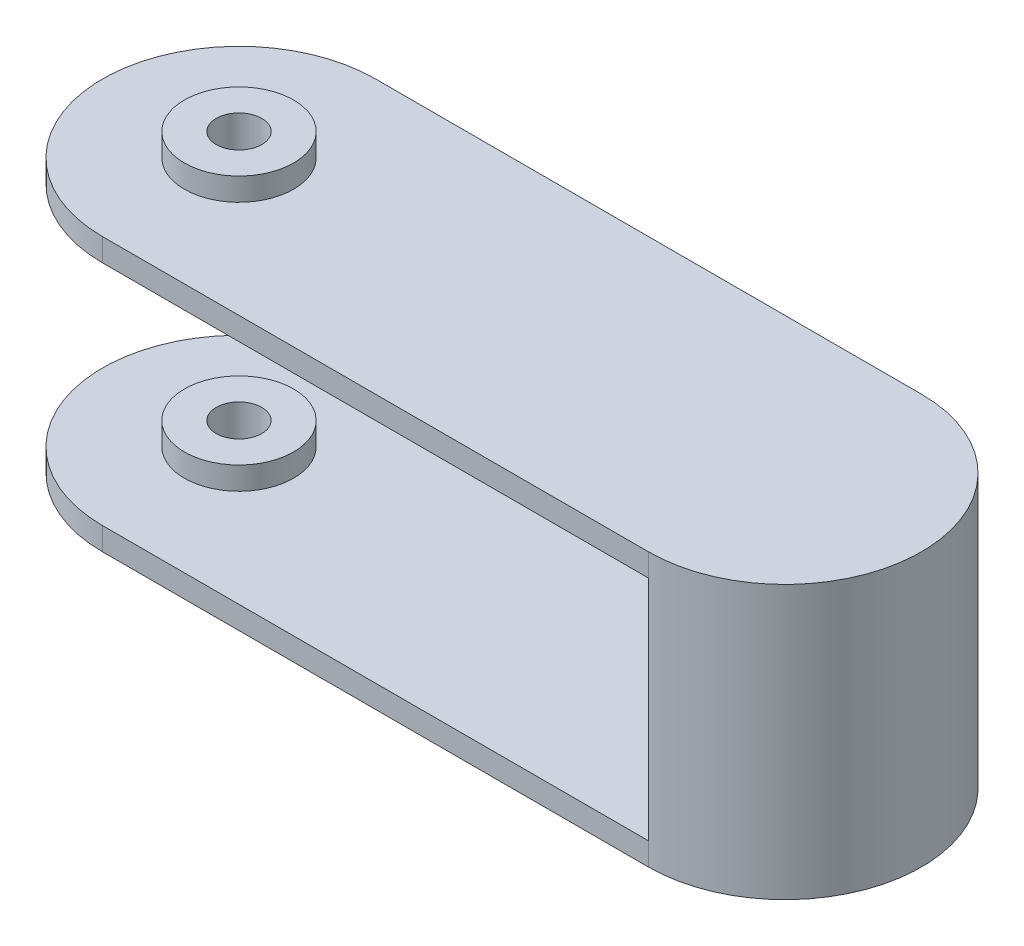
ISO-10303-21;
HEADER;
FILE_DESCRIPTION(('STEP AP214'),'2;1');
FILE_NAME('part.step','',(''),(''),'','','');
FILE_SCHEMA(('AUTOMOTIVE_DESIGN { 1 0 10303 214 1 1 1 1 }'));
ENDSEC;
DATA;
#1=APPLICATION_CONTEXT('core data for automotive mechanical design processes');
#2=APPLICATION_PROTOCOL_DEFINITION('international standard','automotive_design',2000,#1);
#3=PRODUCT_CONTEXT('',#1,'mechanical');
#4=PRODUCT('Part','Part','',(#3));
#5=PRODUCT_RELATED_PRODUCT_CATEGORY('part','',(#4));
#6=PRODUCT_DEFINITION_FORMATION('','',#4);
#7=PRODUCT_DEFINITION_CONTEXT('part definition',#1,'design');
#8=PRODUCT_DEFINITION('design','',#6,#7);
#9=PRODUCT_DEFINITION_SHAPE('','',#8);
#10=(LENGTH_UNIT() NAMED_UNIT(*) SI_UNIT(.MILLI.,.METRE.));
#11=(NAMED_UNIT(*) PLANE_ANGLE_UNIT() SI_UNIT($,.RADIAN.));
#12=(NAMED_UNIT(*) SI_UNIT($,.STERADIAN.) SOLID_ANGLE_UNIT());
#13=UNCERTAINTY_MEASURE_WITH_UNIT(LENGTH_MEASURE(1.E-05),#10,'distance_accuracy_value','');
#14=(GEOMETRIC_REPRESENTATION_CONTEXT(3) GLOBAL_UNCERTAINTY_ASSIGNED_CONTEXT((#13)) GLOBAL_UNIT_ASSIGNED_CONTEXT((#10,
#11,#12)) REPRESENTATION_CONTEXT('',''));
#15=CARTESIAN_POINT('',(0.,0.,0.));
#16=DIRECTION('',(0.,0.,1.));
#17=DIRECTION('',(1.,0.,0.));
#18=AXIS2_PLACEMENT_3D('',#15,#16,#17);
#19=CARTESIAN_POINT('',(-30.,30.,0.));
#20=DIRECTION('',(0.,1.,0.));
#21=DIRECTION('',(0.,0.,1.));
#22=AXIS2_PLACEMENT_3D('',#19,#20,#21);
#23=PLANE('',#22);
#24=CARTESIAN_POINT('',(-30.,30.,0.));
#25=DIRECTION('',(0.,1.,0.));
#26=DIRECTION('',(0.,0.,1.));
#27=AXIS2_PLACEMENT_3D('',#24,#25,#26);
#28=CIRCLE('',#27,15.);
#29=CARTESIAN_POINT('',(-30.,30.,-15.));
#30=VERTEX_POINT('',#29);
#31=CARTESIAN_POINT('',(-30.,30.,15.));
#32=VERTEX_POINT('',#31);
#33=EDGE_CURVE('E184',#30,#32,#28,.T.);
#34=ORIENTED_EDGE('',*,*,#33,.T.);
#35=DIRECTION('',(1.,0.,0.));
#36=VECTOR('',#35,1.);
#37=CARTESIAN_POINT('',(-30.,30.,15.));
#38=LINE('',#37,#36);
#39=CARTESIAN_POINT('',(30.,30.,15.));
#40=VERTEX_POINT('',#39);
#41=EDGE_CURVE('E102',#32,#40,#38,.T.);
#42=ORIENTED_EDGE('',*,*,#41,.T.);
#43=CARTESIAN_POINT('',(30.,30.,0.));
#44=DIRECTION('',(0.,1.,0.));
#45=DIRECTION('',(0.,0.,1.));
#46=AXIS2_PLACEMENT_3D('',#43,#44,#45);
#47=CIRCLE('',#46,15.);
#48=CARTESIAN_POINT('',(30.,30.,-15.));
#49=VERTEX_POINT('',#48);
#50=EDGE_CURVE('E190',#40,#49,#47,.T.);
#51=ORIENTED_EDGE('',*,*,#50,.T.);
#52=DIRECTION('',(1.,0.,0.));
#53=VECTOR('',#52,1.);
#54=CARTESIAN_POINT('',(-30.,30.,-15.));
#55=LINE('',#54,#53);
#56=EDGE_CURVE('E154',#30,#49,#55,.T.);
#57=ORIENTED_EDGE('',*,*,#56,.F.);
#58=EDGE_LOOP('',(#34,#42,#51,#57));
#59=FACE_BOUND('',#58,.T.);
#60=CARTESIAN_POINT('',(-30.,30.,0.));
#61=DIRECTION('',(0.,1.,0.));
#62=DIRECTION('',(0.,0.,1.));
#63=AXIS2_PLACEMENT_3D('',#60,#61,#62);
#64=CIRCLE('',#63,6.);
#65=CARTESIAN_POINT('',(-30.,30.,6.));
#66=VERTEX_POINT('',#65);
#67=EDGE_CURVE('E421',#66,#66,#64,.T.);
#68=ORIENTED_EDGE('',*,*,#67,.F.);
#69=EDGE_LOOP('',(#68));
#70=FACE_BOUND('',#69,.T.);
#71=ADVANCED_FACE('F45',(#59,#70),#23,.T.);
#72=CARTESIAN_POINT('',(-30.,30.,0.));
#73=DIRECTION('',(0.,-1.,0.));
#74=DIRECTION('',(0.,0.,-1.));
#75=AXIS2_PLACEMENT_3D('',#72,#73,#74);
#76=CYLINDRICAL_SURFACE('',#75,15.);
#77=DIRECTION('',(0.,-1.,0.));
#78=VECTOR('',#77,1.);
#79=CARTESIAN_POINT('',(-30.,30.,-15.));
#80=LINE('',#79,#78);
#81=CARTESIAN_POINT('',(-30.,27.5,-15.));
#82=VERTEX_POINT('',#81);
#83=EDGE_CURVE('E72',#30,#82,#80,.T.);
#84=ORIENTED_EDGE('',*,*,#83,.T.);
#85=CARTESIAN_POINT('',(-30.,27.5,0.));
#86=DIRECTION('',(0.,1.,0.));
#87=DIRECTION('',(0.,0.,1.));
#88=AXIS2_PLACEMENT_3D('',#85,#86,#87);
#89=CIRCLE('',#88,15.);
#90=CARTESIAN_POINT('',(-30.,27.5,15.));
#91=VERTEX_POINT('',#90);
#92=EDGE_CURVE('E137',#82,#91,#89,.T.);
#93=ORIENTED_EDGE('',*,*,#92,.T.);
#94=DIRECTION('',(0.,-1.,0.));
#95=VECTOR('',#94,1.);
#96=CARTESIAN_POINT('',(-30.,30.,15.));
#97=LINE('',#96,#95);
#98=EDGE_CURVE('E11',#32,#91,#97,.T.);
#99=ORIENTED_EDGE('',*,*,#98,.F.);
#100=ORIENTED_EDGE('',*,*,#33,.F.);
#101=EDGE_LOOP('',(#84,#93,#99,#100));
#102=FACE_BOUND('',#101,.T.);
#103=ADVANCED_FACE('F221',(#102),#76,.T.);
#104=CARTESIAN_POINT('',(-30.,30.,15.));
#105=DIRECTION('',(0.,0.,-1.));
#106=DIRECTION('',(-1.,0.,0.));
#107=AXIS2_PLACEMENT_3D('',#104,#105,#106);
#108=PLANE('',#107);
#109=ORIENTED_EDGE('',*,*,#98,.T.);
#110=DIRECTION('',(-1.,0.,0.));
#111=VECTOR('',#110,1.);
#112=CARTESIAN_POINT('',(-45.,27.5,15.));
#113=LINE('',#112,#111);
#114=CARTESIAN_POINT('',(30.,27.5,15.));
#115=VERTEX_POINT('',#114);
#116=EDGE_CURVE('E409',#115,#91,#113,.T.);
#117=ORIENTED_EDGE('',*,*,#116,.F.);
#118=DIRECTION('',(0.,-1.,0.));
#119=VECTOR('',#118,1.);
#120=CARTESIAN_POINT('',(30.,30.,15.));
#121=LINE('',#120,#119);
#122=EDGE_CURVE('E160',#40,#115,#121,.T.);
#123=ORIENTED_EDGE('',*,*,#122,.F.);
#124=ORIENTED_EDGE('',*,*,#41,.F.);
#125=EDGE_LOOP('',(#109,#117,#123,#124));
#126=FACE_BOUND('',#125,.T.);
#127=ADVANCED_FACE('F226',(#126),#108,.F.);
#128=CARTESIAN_POINT('',(-30.,30.,-15.));
#129=DIRECTION('',(0.,0.,-1.));
#130=DIRECTION('',(-1.,0.,0.));
#131=AXIS2_PLACEMENT_3D('',#128,#129,#130);
#132=PLANE('',#131);
#133=DIRECTION('',(-1.,0.,0.));
#134=VECTOR('',#133,1.);
#135=CARTESIAN_POINT('',(-45.,27.5,-15.));
#136=LINE('',#135,#134);
#137=CARTESIAN_POINT('',(30.,27.5,-15.));
#138=VERTEX_POINT('',#137);
#139=EDGE_CURVE('E135',#138,#82,#136,.T.);
#140=ORIENTED_EDGE('',*,*,#139,.T.);
#141=ORIENTED_EDGE('',*,*,#83,.F.);
#142=ORIENTED_EDGE('',*,*,#56,.T.);
#143=DIRECTION('',(0.,-1.,0.));
#144=VECTOR('',#143,1.);
#145=CARTESIAN_POINT('',(30.,30.,-15.));
#146=LINE('',#145,#144);
#147=EDGE_CURVE('E147',#49,#138,#146,.T.);
#148=ORIENTED_EDGE('',*,*,#147,.T.);
#149=EDGE_LOOP('',(#140,#141,#142,#148));
#150=FACE_BOUND('',#149,.T.);
#151=ADVANCED_FACE('F152',(#150),#132,.T.);
#152=CARTESIAN_POINT('',(-30.,30.000012,0.));
#153=DIRECTION('',(0.,-1.,0.));
#154=DIRECTION('',(0.,0.,-1.));
#155=AXIS2_PLACEMENT_3D('',#152,#153,#154);
#156=CYLINDRICAL_SURFACE('',#155,2.5);
#157=CARTESIAN_POINT('',(-30.,27.5,0.));
#158=DIRECTION('',(0.,1.,0.));
#159=DIRECTION('',(0.,0.,1.));
#160=AXIS2_PLACEMENT_3D('',#157,#158,#159);
#161=CIRCLE('',#160,2.5);
#162=CARTESIAN_POINT('',(-30.,27.5,2.5));
#163=VERTEX_POINT('',#162);
#164=EDGE_CURVE('E171',#163,#163,#161,.T.);
#165=ORIENTED_EDGE('',*,*,#164,.F.);
#166=EDGE_LOOP('',(#165));
#167=FACE_BOUND('',#166,.T.);
#168=CARTESIAN_POINT('',(-30.,32.5,0.));
#169=DIRECTION('',(0.,1.,0.));
#170=DIRECTION('',(0.,0.,1.));
#171=AXIS2_PLACEMENT_3D('',#168,#169,#170);
#172=CIRCLE('',#171,2.5);
#173=CARTESIAN_POINT('',(-30.,32.5,2.5));
#174=VERTEX_POINT('',#173);
#175=EDGE_CURVE('E425',#174,#174,#172,.T.);
#176=ORIENTED_EDGE('',*,*,#175,.T.);
#177=EDGE_LOOP('',(#176));
#178=FACE_BOUND('',#177,.T.);
#179=ADVANCED_FACE('F220',(#167,#178),#156,.F.);
#180=CARTESIAN_POINT('',(-30.,2.5,15.));
#181=VERTEX_POINT('',#180);
#182=CARTESIAN_POINT('',(-30.,0.,15.));
#183=VERTEX_POINT('',#182);
#184=EDGE_CURVE('E55',#181,#183,#97,.T.);
#185=ORIENTED_EDGE('',*,*,#184,.F.);
#186=CARTESIAN_POINT('',(-30.,2.5,0.));
#187=DIRECTION('',(0.,-1.,0.));
#188=DIRECTION('',(0.,0.,-1.));
#189=AXIS2_PLACEMENT_3D('',#186,#187,#188);
#190=CIRCLE('',#189,15.);
#191=CARTESIAN_POINT('',(-30.,2.5,-15.));
#192=VERTEX_POINT('',#191);
#193=EDGE_CURVE('E132',#181,#192,#190,.T.);
#194=ORIENTED_EDGE('',*,*,#193,.T.);
#195=CARTESIAN_POINT('',(-30.,0.,-15.));
#196=VERTEX_POINT('',#195);
#197=EDGE_CURVE('E95',#192,#196,#80,.T.);
#198=ORIENTED_EDGE('',*,*,#197,.T.);
#199=CARTESIAN_POINT('',(-30.,0.,0.));
#200=DIRECTION('',(0.,1.,0.));
#201=DIRECTION('',(0.,0.,1.));
#202=AXIS2_PLACEMENT_3D('',#199,#200,#201);
#203=CIRCLE('',#202,15.);
#204=EDGE_CURVE('E170',#196,#183,#203,.T.);
#205=ORIENTED_EDGE('',*,*,#204,.T.);
#206=EDGE_LOOP('',(#185,#194,#198,#205));
#207=FACE_BOUND('',#206,.T.);
#208=ADVANCED_FACE('F47',(#207),#76,.T.);
#209=CARTESIAN_POINT('',(30.,2.5,15.));
#210=VERTEX_POINT('',#209);
#211=CARTESIAN_POINT('',(30.,0.,15.));
#212=VERTEX_POINT('',#211);
#213=EDGE_CURVE('E156',#210,#212,#121,.T.);
#214=ORIENTED_EDGE('',*,*,#213,.F.);
#215=DIRECTION('',(1.,0.,0.));
#216=VECTOR('',#215,1.);
#217=CARTESIAN_POINT('',(-45.,2.5,15.));
#218=LINE('',#217,#216);
#219=EDGE_CURVE('E415',#181,#210,#218,.T.);
#220=ORIENTED_EDGE('',*,*,#219,.F.);
#221=ORIENTED_EDGE('',*,*,#184,.T.);
#222=DIRECTION('',(1.,0.,0.));
#223=VECTOR('',#222,1.);
#224=CARTESIAN_POINT('',(-30.,0.,15.));
#225=LINE('',#224,#223);
#226=EDGE_CURVE('E197',#183,#212,#225,.T.);
#227=ORIENTED_EDGE('',*,*,#226,.T.);
#228=EDGE_LOOP('',(#214,#220,#221,#227));
#229=FACE_BOUND('',#228,.T.);
#230=ADVANCED_FACE('F217',(#229),#108,.F.);
#231=CARTESIAN_POINT('',(30.,30.,0.));
#232=DIRECTION('',(0.,-1.,0.));
#233=DIRECTION('',(0.,0.,-1.));
#234=AXIS2_PLACEMENT_3D('',#231,#232,#233);
#235=CYLINDRICAL_SURFACE('',#234,15.);
#236=CARTESIAN_POINT('',(30.,0.,0.));
#237=DIRECTION('',(0.,1.,0.));
#238=DIRECTION('',(0.,0.,1.));
#239=AXIS2_PLACEMENT_3D('',#236,#237,#238);
#240=CIRCLE('',#239,15.);
#241=CARTESIAN_POINT('',(30.,0.,-15.));
#242=VERTEX_POINT('',#241);
#243=EDGE_CURVE('E201',#212,#242,#240,.T.);
#244=ORIENTED_EDGE('',*,*,#243,.T.);
#245=CARTESIAN_POINT('',(30.,2.5,-15.));
#246=VERTEX_POINT('',#245);
#247=EDGE_CURVE('E148',#246,#242,#146,.T.);
#248=ORIENTED_EDGE('',*,*,#247,.F.);
#249=DIRECTION('',(0.,1.,0.));
#250=VECTOR('',#249,1.);
#251=CARTESIAN_POINT('',(30.,27.5,-15.));
#252=LINE('',#251,#250);
#253=EDGE_CURVE('E63',#246,#138,#252,.T.);
#254=ORIENTED_EDGE('',*,*,#253,.T.);
#255=ORIENTED_EDGE('',*,*,#147,.F.);
#256=ORIENTED_EDGE('',*,*,#50,.F.);
#257=ORIENTED_EDGE('',*,*,#122,.T.);
#258=DIRECTION('',(0.,1.,0.));
#259=VECTOR('',#258,1.);
#260=CARTESIAN_POINT('',(30.,27.5,15.));
#261=LINE('',#260,#259);
#262=EDGE_CURVE('E127',#210,#115,#261,.T.);
#263=ORIENTED_EDGE('',*,*,#262,.F.);
#264=ORIENTED_EDGE('',*,*,#213,.T.);
#265=EDGE_LOOP('',(#244,#248,#254,#255,#256,#257,#263,#264));
#266=FACE_BOUND('',#265,.T.);
#267=ADVANCED_FACE('F145',(#266),#235,.T.);
#268=DIRECTION('',(1.,0.,0.));
#269=VECTOR('',#268,1.);
#270=CARTESIAN_POINT('',(-45.,2.5,-15.));
#271=LINE('',#270,#269);
#272=EDGE_CURVE('E150',#192,#246,#271,.T.);
#273=ORIENTED_EDGE('',*,*,#272,.T.);
#274=ORIENTED_EDGE('',*,*,#247,.T.);
#275=DIRECTION('',(1.,0.,0.));
#276=VECTOR('',#275,1.);
#277=CARTESIAN_POINT('',(-30.,0.,-15.));
#278=LINE('',#277,#276);
#279=EDGE_CURVE('E187',#196,#242,#278,.T.);
#280=ORIENTED_EDGE('',*,*,#279,.F.);
#281=ORIENTED_EDGE('',*,*,#197,.F.);
#282=EDGE_LOOP('',(#273,#274,#280,#281));
#283=FACE_BOUND('',#282,.T.);
#284=ADVANCED_FACE('F213',(#283),#132,.T.);
#285=CARTESIAN_POINT('',(-30.,0.,0.));
#286=DIRECTION('',(0.,1.,0.));
#287=DIRECTION('',(0.,0.,1.));
#288=AXIS2_PLACEMENT_3D('',#285,#286,#287);
#289=PLANE('',#288);
#290=ORIENTED_EDGE('',*,*,#204,.F.);
#291=ORIENTED_EDGE('',*,*,#279,.T.);
#292=ORIENTED_EDGE('',*,*,#243,.F.);
#293=ORIENTED_EDGE('',*,*,#226,.F.);
#294=EDGE_LOOP('',(#290,#291,#292,#293));
#295=FACE_BOUND('',#294,.T.);
#296=CARTESIAN_POINT('',(-30.,0.,0.));
#297=DIRECTION('',(0.,1.,0.));
#298=DIRECTION('',(0.,0.,1.));
#299=AXIS2_PLACEMENT_3D('',#296,#297,#298);
#300=CIRCLE('',#299,2.5);
#301=CARTESIAN_POINT('',(-30.,0.,2.5));
#302=VERTEX_POINT('',#301);
#303=EDGE_CURVE('E167',#302,#302,#300,.F.);
#304=ORIENTED_EDGE('',*,*,#303,.F.);
#305=EDGE_LOOP('',(#304));
#306=FACE_BOUND('',#305,.T.);
#307=ADVANCED_FACE('F208',(#295,#306),#289,.F.);
#308=ORIENTED_EDGE('',*,*,#303,.T.);
#309=EDGE_LOOP('',(#308));
#310=FACE_BOUND('',#309,.T.);
#311=CARTESIAN_POINT('',(-30.,5.,0.));
#312=DIRECTION('',(0.,-1.,0.));
#313=DIRECTION('',(0.,0.,-1.));
#314=AXIS2_PLACEMENT_3D('',#311,#312,#313);
#315=CIRCLE('',#314,2.5);
#316=CARTESIAN_POINT('',(-30.,5.,-2.5));
#317=VERTEX_POINT('',#316);
#318=EDGE_CURVE('E436',#317,#317,#315,.F.);
#319=ORIENTED_EDGE('',*,*,#318,.T.);
#320=EDGE_LOOP('',(#319));
#321=FACE_BOUND('',#320,.T.);
#322=ADVANCED_FACE('F229',(#310,#321),#156,.F.);
#323=CARTESIAN_POINT('',(-45.,27.5,-15.));
#324=DIRECTION('',(0.,1.,0.));
#325=DIRECTION('',(0.,0.,1.));
#326=AXIS2_PLACEMENT_3D('',#323,#324,#325);
#327=PLANE('',#326);
#328=ORIENTED_EDGE('',*,*,#164,.T.);
#329=EDGE_LOOP('',(#328));
#330=FACE_BOUND('',#329,.T.);
#331=ORIENTED_EDGE('',*,*,#139,.F.);
#332=DIRECTION('',(0.,0.,1.));
#333=VECTOR('',#332,1.);
#334=CARTESIAN_POINT('',(30.,27.5,-15.));
#335=LINE('',#334,#333);
#336=EDGE_CURVE('E123',#138,#115,#335,.T.);
#337=ORIENTED_EDGE('',*,*,#336,.T.);
#338=ORIENTED_EDGE('',*,*,#116,.T.);
#339=ORIENTED_EDGE('',*,*,#92,.F.);
#340=EDGE_LOOP('',(#331,#337,#338,#339));
#341=FACE_BOUND('',#340,.T.);
#342=ADVANCED_FACE('F136',(#330,#341),#327,.F.);
#343=CARTESIAN_POINT('',(-45.,2.5,-15.));
#344=DIRECTION('',(0.,-1.,0.));
#345=DIRECTION('',(0.,0.,-1.));
#346=AXIS2_PLACEMENT_3D('',#343,#344,#345);
#347=PLANE('',#346);
#348=CARTESIAN_POINT('',(-30.,2.5,0.));
#349=DIRECTION('',(0.,-1.,0.));
#350=DIRECTION('',(0.,0.,-1.));
#351=AXIS2_PLACEMENT_3D('',#348,#349,#350);
#352=CIRCLE('',#351,6.);
#353=CARTESIAN_POINT('',(-30.,2.5,-6.));
#354=VERTEX_POINT('',#353);
#355=EDGE_CURVE('E49',#354,#354,#352,.T.);
#356=ORIENTED_EDGE('',*,*,#355,.T.);
#357=EDGE_LOOP('',(#356));
#358=FACE_BOUND('',#357,.T.);
#359=ORIENTED_EDGE('',*,*,#219,.T.);
#360=DIRECTION('',(0.,0.,1.));
#361=VECTOR('',#360,1.);
#362=CARTESIAN_POINT('',(30.,2.5,-15.));
#363=LINE('',#362,#361);
#364=EDGE_CURVE('E133',#246,#210,#363,.T.);
#365=ORIENTED_EDGE('',*,*,#364,.F.);
#366=ORIENTED_EDGE('',*,*,#272,.F.);
#367=ORIENTED_EDGE('',*,*,#193,.F.);
#368=EDGE_LOOP('',(#359,#365,#366,#367));
#369=FACE_BOUND('',#368,.T.);
#370=ADVANCED_FACE('F271',(#358,#369),#347,.F.);
#371=CARTESIAN_POINT('',(30.,27.5,-15.));
#372=DIRECTION('',(1.,0.,0.));
#373=DIRECTION('',(0.,1.,0.));
#374=AXIS2_PLACEMENT_3D('',#371,#372,#373);
#375=PLANE('',#374);
#376=ORIENTED_EDGE('',*,*,#262,.T.);
#377=ORIENTED_EDGE('',*,*,#336,.F.);
#378=ORIENTED_EDGE('',*,*,#253,.F.);
#379=ORIENTED_EDGE('',*,*,#364,.T.);
#380=EDGE_LOOP('',(#376,#377,#378,#379));
#381=FACE_BOUND('',#380,.T.);
#382=ADVANCED_FACE('F125',(#381),#375,.F.);
#383=CARTESIAN_POINT('',(-30.,32.5,0.));
#384=DIRECTION('',(0.,1.,0.));
#385=DIRECTION('',(0.,0.,1.));
#386=AXIS2_PLACEMENT_3D('',#383,#384,#385);
#387=PLANE('',#386);
#388=CARTESIAN_POINT('',(-30.,32.5,0.));
#389=DIRECTION('',(0.,1.,0.));
#390=DIRECTION('',(0.,0.,1.));
#391=AXIS2_PLACEMENT_3D('',#388,#389,#390);
#392=CIRCLE('',#391,6.);
#393=CARTESIAN_POINT('',(-30.,32.5,6.));
#394=VERTEX_POINT('',#393);
#395=EDGE_CURVE('E419',#394,#394,#392,.T.);
#396=ORIENTED_EDGE('',*,*,#395,.T.);
#397=EDGE_LOOP('',(#396));
#398=FACE_BOUND('',#397,.T.);
#399=ORIENTED_EDGE('',*,*,#175,.F.);
#400=EDGE_LOOP('',(#399));
#401=FACE_BOUND('',#400,.T.);
#402=ADVANCED_FACE('F284',(#398,#401),#387,.T.);
#403=CARTESIAN_POINT('',(-30.,32.5,0.));
#404=DIRECTION('',(0.,-1.,0.));
#405=DIRECTION('',(0.,0.,-1.));
#406=AXIS2_PLACEMENT_3D('',#403,#404,#405);
#407=CYLINDRICAL_SURFACE('',#406,6.);
#408=ORIENTED_EDGE('',*,*,#395,.F.);
#409=EDGE_LOOP('',(#408));
#410=FACE_BOUND('',#409,.T.);
#411=ORIENTED_EDGE('',*,*,#67,.T.);
#412=EDGE_LOOP('',(#411));
#413=FACE_BOUND('',#412,.T.);
#414=ADVANCED_FACE('F291',(#410,#413),#407,.T.);
#415=CARTESIAN_POINT('',(-30.,5.,0.));
#416=DIRECTION('',(0.,-1.,0.));
#417=DIRECTION('',(0.,0.,-1.));
#418=AXIS2_PLACEMENT_3D('',#415,#416,#417);
#419=CYLINDRICAL_SURFACE('',#418,6.);
#420=CARTESIAN_POINT('',(-30.,5.,0.));
#421=DIRECTION('',(0.,-1.,0.));
#422=DIRECTION('',(0.,0.,-1.));
#423=AXIS2_PLACEMENT_3D('',#420,#421,#422);
#424=CIRCLE('',#423,6.);
#425=CARTESIAN_POINT('',(-30.,5.,-6.));
#426=VERTEX_POINT('',#425);
#427=EDGE_CURVE('E432',#426,#426,#424,.T.);
#428=ORIENTED_EDGE('',*,*,#427,.T.);
#429=EDGE_LOOP('',(#428));
#430=FACE_BOUND('',#429,.T.);
#431=ORIENTED_EDGE('',*,*,#355,.F.);
#432=EDGE_LOOP('',(#431));
#433=FACE_BOUND('',#432,.T.);
#434=ADVANCED_FACE('F299',(#430,#433),#419,.T.);
#435=CARTESIAN_POINT('',(0.,5.,0.));
#436=DIRECTION('',(0.,-1.,0.));
#437=DIRECTION('',(0.,0.,-1.));
#438=AXIS2_PLACEMENT_3D('',#435,#436,#437);
#439=PLANE('',#438);
#440=ORIENTED_EDGE('',*,*,#318,.F.);
#441=EDGE_LOOP('',(#440));
#442=FACE_BOUND('',#441,.T.);
#443=ORIENTED_EDGE('',*,*,#427,.F.);
#444=EDGE_LOOP('',(#443));
#445=FACE_BOUND('',#444,.T.);
#446=ADVANCED_FACE('F306',(#442,#445),#439,.F.);
#447=CLOSED_SHELL('',(#71,#103,#127,#151,#179,#208,#230,#267,#284,#307,#322,#342,#370,#382,#402,
#414,#434,#446));
#448=MANIFOLD_SOLID_BREP('B2',#447);
#449=ADVANCED_BREP_SHAPE_REPRESENTATION('',(#18,#448),#14);
#450=SHAPE_DEFINITION_REPRESENTATION(#9,#449);
ENDSEC;
END-ISO-10303-21;
